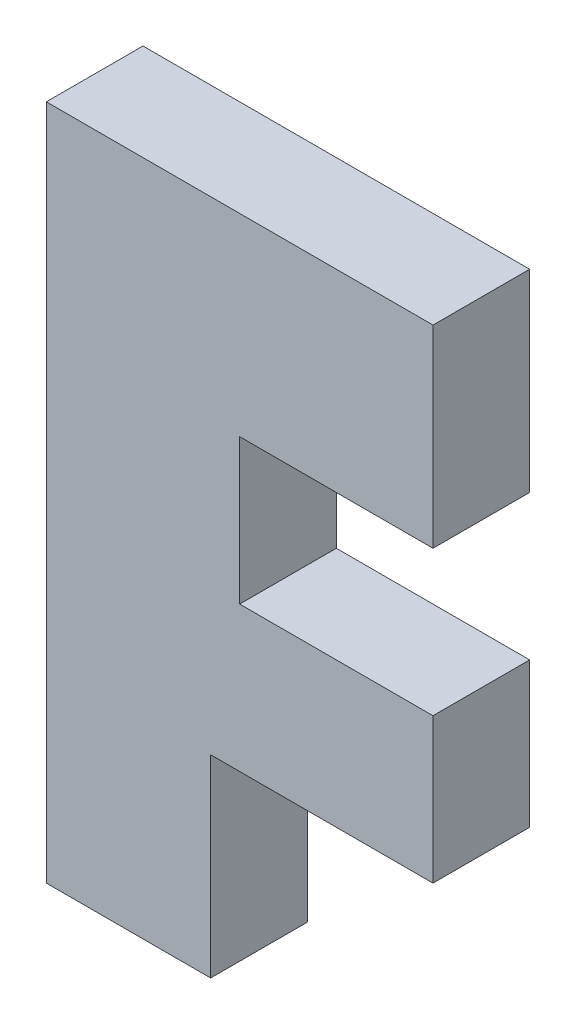
ISO-10303-21;
HEADER;
FILE_DESCRIPTION(('STEP AP214'),'2;1');
FILE_NAME('part.step','',(''),(''),'','','');
FILE_SCHEMA(('AUTOMOTIVE_DESIGN { 1 0 10303 214 1 1 1 1 }'));
ENDSEC;
DATA;
#1=APPLICATION_CONTEXT('core data for automotive mechanical design processes');
#2=APPLICATION_PROTOCOL_DEFINITION('international standard','automotive_design',2000,#1);
#3=PRODUCT_CONTEXT('',#1,'mechanical');
#4=PRODUCT('Part','Part','',(#3));
#5=PRODUCT_RELATED_PRODUCT_CATEGORY('part','',(#4));
#6=PRODUCT_DEFINITION_FORMATION('','',#4);
#7=PRODUCT_DEFINITION_CONTEXT('part definition',#1,'design');
#8=PRODUCT_DEFINITION('design','',#6,#7);
#9=PRODUCT_DEFINITION_SHAPE('','',#8);
#10=(LENGTH_UNIT() NAMED_UNIT(*) SI_UNIT(.MILLI.,.METRE.));
#11=(NAMED_UNIT(*) PLANE_ANGLE_UNIT() SI_UNIT($,.RADIAN.));
#12=(NAMED_UNIT(*) SI_UNIT($,.STERADIAN.) SOLID_ANGLE_UNIT());
#13=UNCERTAINTY_MEASURE_WITH_UNIT(LENGTH_MEASURE(1.E-05),#10,'distance_accuracy_value','');
#14=(GEOMETRIC_REPRESENTATION_CONTEXT(3) GLOBAL_UNCERTAINTY_ASSIGNED_CONTEXT((#13)) GLOBAL_UNIT_ASSIGNED_CONTEXT((#10,
#11,#12)) REPRESENTATION_CONTEXT('',''));
#15=CARTESIAN_POINT('',(0.,0.,0.));
#16=DIRECTION('',(0.,0.,1.));
#17=DIRECTION('',(1.,0.,0.));
#18=AXIS2_PLACEMENT_3D('',#15,#16,#17);
#19=CARTESIAN_POINT('',(0.,0.,12.7));
#20=DIRECTION('',(0.,1.,0.));
#21=DIRECTION('',(0.,0.,1.));
#22=AXIS2_PLACEMENT_3D('',#19,#20,#21);
#23=PLANE('',#22);
#24=DIRECTION('',(1.,0.,0.));
#25=VECTOR('',#24,1.);
#26=CARTESIAN_POINT('',(0.,0.,0.));
#27=LINE('',#26,#25);
#28=CARTESIAN_POINT('',(0.,0.,0.));
#29=VERTEX_POINT('',#28);
#30=CARTESIAN_POINT('',(21.59,0.,0.));
#31=VERTEX_POINT('',#30);
#32=EDGE_CURVE('E142',#29,#31,#27,.T.);
#33=ORIENTED_EDGE('',*,*,#32,.T.);
#34=DIRECTION('',(0.,0.,-1.));
#35=VECTOR('',#34,1.);
#36=CARTESIAN_POINT('',(21.59,0.,12.7));
#37=LINE('',#36,#35);
#38=CARTESIAN_POINT('',(21.59,0.,12.7));
#39=VERTEX_POINT('',#38);
#40=EDGE_CURVE('E11',#39,#31,#37,.T.);
#41=ORIENTED_EDGE('',*,*,#40,.F.);
#42=DIRECTION('',(1.,0.,0.));
#43=VECTOR('',#42,1.);
#44=CARTESIAN_POINT('',(0.,0.,12.7));
#45=LINE('',#44,#43);
#46=CARTESIAN_POINT('',(0.,0.,12.7));
#47=VERTEX_POINT('',#46);
#48=EDGE_CURVE('E167',#47,#39,#45,.T.);
#49=ORIENTED_EDGE('',*,*,#48,.F.);
#50=DIRECTION('',(0.,0.,-1.));
#51=VECTOR('',#50,1.);
#52=CARTESIAN_POINT('',(0.,0.,12.7));
#53=LINE('',#52,#51);
#54=EDGE_CURVE('E49',#47,#29,#53,.T.);
#55=ORIENTED_EDGE('',*,*,#54,.T.);
#56=EDGE_LOOP('',(#33,#41,#49,#55));
#57=FACE_BOUND('',#56,.T.);
#58=ADVANCED_FACE('F33',(#57),#23,.F.);
#59=CARTESIAN_POINT('',(21.59,0.,12.7));
#60=DIRECTION('',(-1.,0.,0.));
#61=DIRECTION('',(0.,0.,1.));
#62=AXIS2_PLACEMENT_3D('',#59,#60,#61);
#63=PLANE('',#62);
#64=DIRECTION('',(0.,1.,0.));
#65=VECTOR('',#64,1.);
#66=CARTESIAN_POINT('',(21.59,0.,0.));
#67=LINE('',#66,#65);
#68=CARTESIAN_POINT('',(21.59,25.4,0.));
#69=VERTEX_POINT('',#68);
#70=EDGE_CURVE('E144',#31,#69,#67,.T.);
#71=ORIENTED_EDGE('',*,*,#70,.T.);
#72=DIRECTION('',(0.,0.,-1.));
#73=VECTOR('',#72,1.);
#74=CARTESIAN_POINT('',(21.59,25.4,12.7));
#75=LINE('',#74,#73);
#76=CARTESIAN_POINT('',(21.59,25.4,12.7));
#77=VERTEX_POINT('',#76);
#78=EDGE_CURVE('E41',#77,#69,#75,.T.);
#79=ORIENTED_EDGE('',*,*,#78,.F.);
#80=DIRECTION('',(0.,1.,0.));
#81=VECTOR('',#80,1.);
#82=CARTESIAN_POINT('',(21.59,0.,12.7));
#83=LINE('',#82,#81);
#84=EDGE_CURVE('E93',#39,#77,#83,.T.);
#85=ORIENTED_EDGE('',*,*,#84,.F.);
#86=ORIENTED_EDGE('',*,*,#40,.T.);
#87=EDGE_LOOP('',(#71,#79,#85,#86));
#88=FACE_BOUND('',#87,.T.);
#89=ADVANCED_FACE('F219',(#88),#63,.F.);
#90=CARTESIAN_POINT('',(21.59,25.4,12.7));
#91=DIRECTION('',(0.,1.,0.));
#92=DIRECTION('',(0.,0.,1.));
#93=AXIS2_PLACEMENT_3D('',#90,#91,#92);
#94=PLANE('',#93);
#95=DIRECTION('',(1.,0.,0.));
#96=VECTOR('',#95,1.);
#97=CARTESIAN_POINT('',(21.59,25.4,0.));
#98=LINE('',#97,#96);
#99=CARTESIAN_POINT('',(50.8,25.4,0.));
#100=VERTEX_POINT('',#99);
#101=EDGE_CURVE('E146',#69,#100,#98,.T.);
#102=ORIENTED_EDGE('',*,*,#101,.T.);
#103=DIRECTION('',(0.,0.,-1.));
#104=VECTOR('',#103,1.);
#105=CARTESIAN_POINT('',(50.8,25.4,12.7));
#106=LINE('',#105,#104);
#107=CARTESIAN_POINT('',(50.8,25.4,12.7));
#108=VERTEX_POINT('',#107);
#109=EDGE_CURVE('E177',#108,#100,#106,.T.);
#110=ORIENTED_EDGE('',*,*,#109,.F.);
#111=DIRECTION('',(1.,0.,0.));
#112=VECTOR('',#111,1.);
#113=CARTESIAN_POINT('',(21.59,25.4,12.7));
#114=LINE('',#113,#112);
#115=EDGE_CURVE('E184',#77,#108,#114,.T.);
#116=ORIENTED_EDGE('',*,*,#115,.F.);
#117=ORIENTED_EDGE('',*,*,#78,.T.);
#118=EDGE_LOOP('',(#102,#110,#116,#117));
#119=FACE_BOUND('',#118,.T.);
#120=ADVANCED_FACE('F182',(#119),#94,.F.);
#121=CARTESIAN_POINT('',(50.8,44.45,12.7));
#122=DIRECTION('',(1.,0.,0.));
#123=DIRECTION('',(0.,0.,-1.));
#124=AXIS2_PLACEMENT_3D('',#121,#122,#123);
#125=PLANE('',#124);
#126=DIRECTION('',(0.,-1.,0.));
#127=VECTOR('',#126,1.);
#128=CARTESIAN_POINT('',(50.8,44.45,0.));
#129=LINE('',#128,#127);
#130=CARTESIAN_POINT('',(50.8,44.45,0.));
#131=VERTEX_POINT('',#130);
#132=EDGE_CURVE('E149',#131,#100,#129,.T.);
#133=ORIENTED_EDGE('',*,*,#132,.F.);
#134=DIRECTION('',(0.,0.,-1.));
#135=VECTOR('',#134,1.);
#136=CARTESIAN_POINT('',(50.8,44.45,12.7));
#137=LINE('',#136,#135);
#138=CARTESIAN_POINT('',(50.8,44.45,12.7));
#139=VERTEX_POINT('',#138);
#140=EDGE_CURVE('E175',#139,#131,#137,.T.);
#141=ORIENTED_EDGE('',*,*,#140,.F.);
#142=DIRECTION('',(0.,-1.,0.));
#143=VECTOR('',#142,1.);
#144=CARTESIAN_POINT('',(50.8,44.45,12.7));
#145=LINE('',#144,#143);
#146=EDGE_CURVE('E193',#139,#108,#145,.T.);
#147=ORIENTED_EDGE('',*,*,#146,.T.);
#148=ORIENTED_EDGE('',*,*,#109,.T.);
#149=EDGE_LOOP('',(#133,#141,#147,#148));
#150=FACE_BOUND('',#149,.T.);
#151=ADVANCED_FACE('F190',(#150),#125,.T.);
#152=CARTESIAN_POINT('',(25.4,44.45,12.7));
#153=DIRECTION('',(0.,1.,0.));
#154=DIRECTION('',(0.,0.,1.));
#155=AXIS2_PLACEMENT_3D('',#152,#153,#154);
#156=PLANE('',#155);
#157=DIRECTION('',(1.,0.,0.));
#158=VECTOR('',#157,1.);
#159=CARTESIAN_POINT('',(25.4,44.45,0.));
#160=LINE('',#159,#158);
#161=CARTESIAN_POINT('',(25.4,44.45,0.));
#162=VERTEX_POINT('',#161);
#163=EDGE_CURVE('E152',#162,#131,#160,.T.);
#164=ORIENTED_EDGE('',*,*,#163,.F.);
#165=DIRECTION('',(0.,0.,-1.));
#166=VECTOR('',#165,1.);
#167=CARTESIAN_POINT('',(25.4,44.45,12.7));
#168=LINE('',#167,#166);
#169=CARTESIAN_POINT('',(25.4,44.45,12.7));
#170=VERTEX_POINT('',#169);
#171=EDGE_CURVE('E173',#170,#162,#168,.T.);
#172=ORIENTED_EDGE('',*,*,#171,.F.);
#173=DIRECTION('',(1.,0.,0.));
#174=VECTOR('',#173,1.);
#175=CARTESIAN_POINT('',(25.4,44.45,12.7));
#176=LINE('',#175,#174);
#177=EDGE_CURVE('E196',#170,#139,#176,.T.);
#178=ORIENTED_EDGE('',*,*,#177,.T.);
#179=ORIENTED_EDGE('',*,*,#140,.T.);
#180=EDGE_LOOP('',(#164,#172,#178,#179));
#181=FACE_BOUND('',#180,.T.);
#182=ADVANCED_FACE('F232',(#181),#156,.T.);
#183=CARTESIAN_POINT('',(25.4,63.5,12.7));
#184=DIRECTION('',(1.,0.,0.));
#185=DIRECTION('',(0.,0.,-1.));
#186=AXIS2_PLACEMENT_3D('',#183,#184,#185);
#187=PLANE('',#186);
#188=DIRECTION('',(0.,-1.,0.));
#189=VECTOR('',#188,1.);
#190=CARTESIAN_POINT('',(25.4,63.5,0.));
#191=LINE('',#190,#189);
#192=CARTESIAN_POINT('',(25.4,63.5,0.));
#193=VERTEX_POINT('',#192);
#194=EDGE_CURVE('E155',#193,#162,#191,.T.);
#195=ORIENTED_EDGE('',*,*,#194,.F.);
#196=DIRECTION('',(0.,0.,-1.));
#197=VECTOR('',#196,1.);
#198=CARTESIAN_POINT('',(25.4,63.5,12.7));
#199=LINE('',#198,#197);
#200=CARTESIAN_POINT('',(25.4,63.5,12.7));
#201=VERTEX_POINT('',#200);
#202=EDGE_CURVE('E171',#201,#193,#199,.T.);
#203=ORIENTED_EDGE('',*,*,#202,.F.);
#204=DIRECTION('',(0.,-1.,0.));
#205=VECTOR('',#204,1.);
#206=CARTESIAN_POINT('',(25.4,63.5,12.7));
#207=LINE('',#206,#205);
#208=EDGE_CURVE('E198',#201,#170,#207,.T.);
#209=ORIENTED_EDGE('',*,*,#208,.T.);
#210=ORIENTED_EDGE('',*,*,#171,.T.);
#211=EDGE_LOOP('',(#195,#203,#209,#210));
#212=FACE_BOUND('',#211,.T.);
#213=ADVANCED_FACE('F235',(#212),#187,.T.);
#214=CARTESIAN_POINT('',(50.8,63.5,12.7));
#215=DIRECTION('',(0.,-1.,0.));
#216=DIRECTION('',(0.,0.,-1.));
#217=AXIS2_PLACEMENT_3D('',#214,#215,#216);
#218=PLANE('',#217);
#219=DIRECTION('',(-1.,0.,0.));
#220=VECTOR('',#219,1.);
#221=CARTESIAN_POINT('',(50.8,63.5,0.));
#222=LINE('',#221,#220);
#223=CARTESIAN_POINT('',(50.8,63.5,0.));
#224=VERTEX_POINT('',#223);
#225=EDGE_CURVE('E158',#224,#193,#222,.T.);
#226=ORIENTED_EDGE('',*,*,#225,.F.);
#227=DIRECTION('',(0.,0.,-1.));
#228=VECTOR('',#227,1.);
#229=CARTESIAN_POINT('',(50.8,63.5,12.7));
#230=LINE('',#229,#228);
#231=CARTESIAN_POINT('',(50.8,63.5,12.7));
#232=VERTEX_POINT('',#231);
#233=EDGE_CURVE('E124',#232,#224,#230,.T.);
#234=ORIENTED_EDGE('',*,*,#233,.F.);
#235=DIRECTION('',(-1.,0.,0.));
#236=VECTOR('',#235,1.);
#237=CARTESIAN_POINT('',(50.8,63.5,12.7));
#238=LINE('',#237,#236);
#239=EDGE_CURVE('E134',#232,#201,#238,.T.);
#240=ORIENTED_EDGE('',*,*,#239,.T.);
#241=ORIENTED_EDGE('',*,*,#202,.T.);
#242=EDGE_LOOP('',(#226,#234,#240,#241));
#243=FACE_BOUND('',#242,.T.);
#244=ADVANCED_FACE('F206',(#243),#218,.T.);
#245=CARTESIAN_POINT('',(50.8,88.9,12.7));
#246=DIRECTION('',(1.,0.,0.));
#247=DIRECTION('',(0.,0.,-1.));
#248=AXIS2_PLACEMENT_3D('',#245,#246,#247);
#249=PLANE('',#248);
#250=DIRECTION('',(0.,-1.,0.));
#251=VECTOR('',#250,1.);
#252=CARTESIAN_POINT('',(50.8,88.9,0.));
#253=LINE('',#252,#251);
#254=CARTESIAN_POINT('',(50.8,88.9,0.));
#255=VERTEX_POINT('',#254);
#256=EDGE_CURVE('E120',#255,#224,#253,.T.);
#257=ORIENTED_EDGE('',*,*,#256,.F.);
#258=DIRECTION('',(0.,0.,-1.));
#259=VECTOR('',#258,1.);
#260=CARTESIAN_POINT('',(50.8,88.9,12.7));
#261=LINE('',#260,#259);
#262=CARTESIAN_POINT('',(50.8,88.9,12.7));
#263=VERTEX_POINT('',#262);
#264=EDGE_CURVE('E115',#263,#255,#261,.T.);
#265=ORIENTED_EDGE('',*,*,#264,.F.);
#266=DIRECTION('',(0.,-1.,0.));
#267=VECTOR('',#266,1.);
#268=CARTESIAN_POINT('',(50.8,88.9,12.7));
#269=LINE('',#268,#267);
#270=EDGE_CURVE('E118',#263,#232,#269,.T.);
#271=ORIENTED_EDGE('',*,*,#270,.T.);
#272=ORIENTED_EDGE('',*,*,#233,.T.);
#273=EDGE_LOOP('',(#257,#265,#271,#272));
#274=FACE_BOUND('',#273,.T.);
#275=ADVANCED_FACE('F117',(#274),#249,.T.);
#276=CARTESIAN_POINT('',(0.,88.9,12.7));
#277=DIRECTION('',(0.,1.,0.));
#278=DIRECTION('',(0.,0.,1.));
#279=AXIS2_PLACEMENT_3D('',#276,#277,#278);
#280=PLANE('',#279);
#281=DIRECTION('',(1.,0.,0.));
#282=VECTOR('',#281,1.);
#283=CARTESIAN_POINT('',(0.,88.9,0.));
#284=LINE('',#283,#282);
#285=CARTESIAN_POINT('',(0.,88.9,0.));
#286=VERTEX_POINT('',#285);
#287=EDGE_CURVE('E162',#286,#255,#284,.T.);
#288=ORIENTED_EDGE('',*,*,#287,.F.);
#289=DIRECTION('',(0.,0.,-1.));
#290=VECTOR('',#289,1.);
#291=CARTESIAN_POINT('',(0.,88.9,12.7));
#292=LINE('',#291,#290);
#293=CARTESIAN_POINT('',(0.,88.9,12.7));
#294=VERTEX_POINT('',#293);
#295=EDGE_CURVE('E81',#294,#286,#292,.T.);
#296=ORIENTED_EDGE('',*,*,#295,.F.);
#297=DIRECTION('',(1.,0.,0.));
#298=VECTOR('',#297,1.);
#299=CARTESIAN_POINT('',(0.,88.9,12.7));
#300=LINE('',#299,#298);
#301=EDGE_CURVE('E131',#294,#263,#300,.T.);
#302=ORIENTED_EDGE('',*,*,#301,.T.);
#303=ORIENTED_EDGE('',*,*,#264,.T.);
#304=EDGE_LOOP('',(#288,#296,#302,#303));
#305=FACE_BOUND('',#304,.T.);
#306=ADVANCED_FACE('F136',(#305),#280,.T.);
#307=CARTESIAN_POINT('',(0.,0.,12.7));
#308=DIRECTION('',(-1.,0.,0.));
#309=DIRECTION('',(0.,0.,1.));
#310=AXIS2_PLACEMENT_3D('',#307,#308,#309);
#311=PLANE('',#310);
#312=DIRECTION('',(0.,1.,0.));
#313=VECTOR('',#312,1.);
#314=CARTESIAN_POINT('',(0.,0.,0.));
#315=LINE('',#314,#313);
#316=EDGE_CURVE('E164',#29,#286,#315,.T.);
#317=ORIENTED_EDGE('',*,*,#316,.F.);
#318=ORIENTED_EDGE('',*,*,#54,.F.);
#319=DIRECTION('',(0.,1.,0.));
#320=VECTOR('',#319,1.);
#321=CARTESIAN_POINT('',(0.,0.,12.7));
#322=LINE('',#321,#320);
#323=EDGE_CURVE('E137',#47,#294,#322,.T.);
#324=ORIENTED_EDGE('',*,*,#323,.T.);
#325=ORIENTED_EDGE('',*,*,#295,.T.);
#326=EDGE_LOOP('',(#317,#318,#324,#325));
#327=FACE_BOUND('',#326,.T.);
#328=ADVANCED_FACE('F208',(#327),#311,.T.);
#329=CARTESIAN_POINT('',(0.,0.,12.7));
#330=DIRECTION('',(0.,0.,1.));
#331=DIRECTION('',(1.,0.,0.));
#332=AXIS2_PLACEMENT_3D('',#329,#330,#331);
#333=PLANE('',#332);
#334=ORIENTED_EDGE('',*,*,#48,.T.);
#335=ORIENTED_EDGE('',*,*,#84,.T.);
#336=ORIENTED_EDGE('',*,*,#115,.T.);
#337=ORIENTED_EDGE('',*,*,#146,.F.);
#338=ORIENTED_EDGE('',*,*,#177,.F.);
#339=ORIENTED_EDGE('',*,*,#208,.F.);
#340=ORIENTED_EDGE('',*,*,#239,.F.);
#341=ORIENTED_EDGE('',*,*,#270,.F.);
#342=ORIENTED_EDGE('',*,*,#301,.F.);
#343=ORIENTED_EDGE('',*,*,#323,.F.);
#344=EDGE_LOOP('',(#334,#335,#336,#337,#338,#339,#340,#341,#342,#343));
#345=FACE_BOUND('',#344,.T.);
#346=ADVANCED_FACE('F129',(#345),#333,.T.);
#347=CARTESIAN_POINT('',(0.,0.,0.));
#348=DIRECTION('',(0.,0.,1.));
#349=DIRECTION('',(1.,0.,0.));
#350=AXIS2_PLACEMENT_3D('',#347,#348,#349);
#351=PLANE('',#350);
#352=ORIENTED_EDGE('',*,*,#32,.F.);
#353=ORIENTED_EDGE('',*,*,#316,.T.);
#354=ORIENTED_EDGE('',*,*,#287,.T.);
#355=ORIENTED_EDGE('',*,*,#256,.T.);
#356=ORIENTED_EDGE('',*,*,#225,.T.);
#357=ORIENTED_EDGE('',*,*,#194,.T.);
#358=ORIENTED_EDGE('',*,*,#163,.T.);
#359=ORIENTED_EDGE('',*,*,#132,.T.);
#360=ORIENTED_EDGE('',*,*,#101,.F.);
#361=ORIENTED_EDGE('',*,*,#70,.F.);
#362=EDGE_LOOP('',(#352,#353,#354,#355,#356,#357,#358,#359,#360,#361));
#363=FACE_BOUND('',#362,.T.);
#364=ADVANCED_FACE('F186',(#363),#351,.F.);
#365=CLOSED_SHELL('',(#58,#89,#120,#151,#182,#213,#244,#275,#306,#328,#346,#364));
#366=MANIFOLD_SOLID_BREP('B2',#365);
#367=ADVANCED_BREP_SHAPE_REPRESENTATION('',(#18,#366),#14);
#368=SHAPE_DEFINITION_REPRESENTATION(#9,#367);
ENDSEC;
END-ISO-10303-21;
